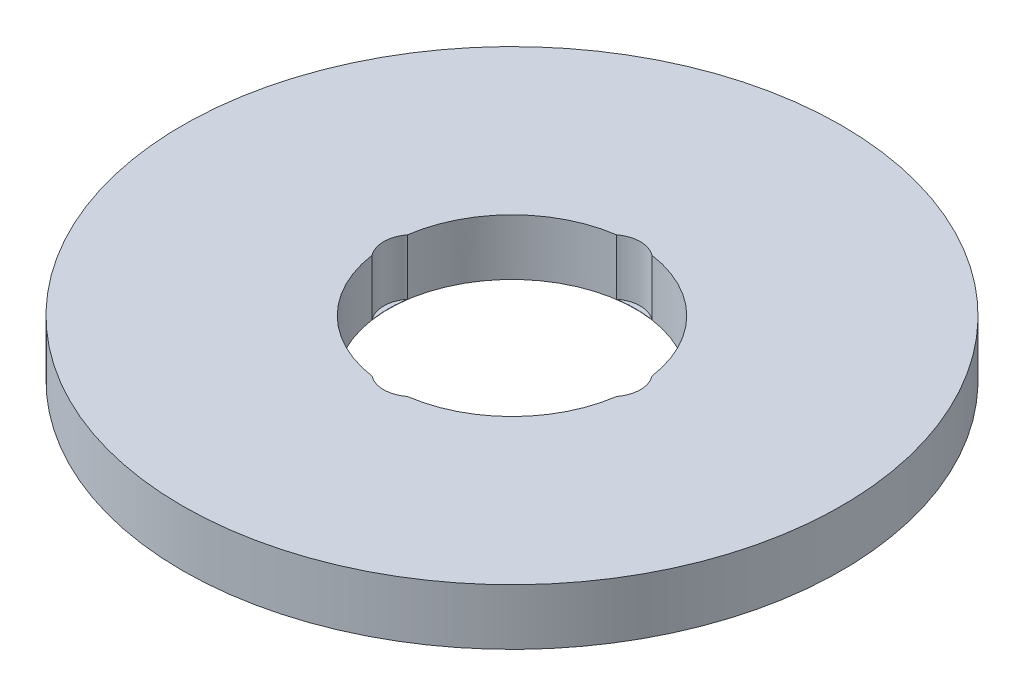
ISO-10303-21;
HEADER;
FILE_DESCRIPTION(('STEP AP214'),'2;1');
FILE_NAME('part.step','',(''),(''),'','','');
FILE_SCHEMA(('AUTOMOTIVE_DESIGN { 1 0 10303 214 1 1 1 1 }'));
ENDSEC;
DATA;
#1=APPLICATION_CONTEXT('core data for automotive mechanical design processes');
#2=APPLICATION_PROTOCOL_DEFINITION('international standard','automotive_design',2000,#1);
#3=PRODUCT_CONTEXT('',#1,'mechanical');
#4=PRODUCT('Part','Part','',(#3));
#5=PRODUCT_RELATED_PRODUCT_CATEGORY('part','',(#4));
#6=PRODUCT_DEFINITION_FORMATION('','',#4);
#7=PRODUCT_DEFINITION_CONTEXT('part definition',#1,'design');
#8=PRODUCT_DEFINITION('design','',#6,#7);
#9=PRODUCT_DEFINITION_SHAPE('','',#8);
#10=(LENGTH_UNIT() NAMED_UNIT(*) SI_UNIT(.MILLI.,.METRE.));
#11=(NAMED_UNIT(*) PLANE_ANGLE_UNIT() SI_UNIT($,.RADIAN.));
#12=(NAMED_UNIT(*) SI_UNIT($,.STERADIAN.) SOLID_ANGLE_UNIT());
#13=UNCERTAINTY_MEASURE_WITH_UNIT(LENGTH_MEASURE(1.E-05),#10,'distance_accuracy_value','');
#14=(GEOMETRIC_REPRESENTATION_CONTEXT(3) GLOBAL_UNCERTAINTY_ASSIGNED_CONTEXT((#13)) GLOBAL_UNIT_ASSIGNED_CONTEXT((#10,
#11,#12)) REPRESENTATION_CONTEXT('',''));
#15=CARTESIAN_POINT('',(0.,0.,0.));
#16=DIRECTION('',(0.,0.,1.));
#17=DIRECTION('',(1.,0.,0.));
#18=AXIS2_PLACEMENT_3D('',#15,#16,#17);
#19=CARTESIAN_POINT('',(0.,17.,0.));
#20=DIRECTION('',(0.,-1.,0.));
#21=DIRECTION('',(0.,0.,-1.));
#22=AXIS2_PLACEMENT_3D('',#19,#20,#21);
#23=CYLINDRICAL_SURFACE('',#22,100.);
#24=CARTESIAN_POINT('',(0.,17.,0.));
#25=DIRECTION('',(0.,1.,0.));
#26=DIRECTION('',(0.,0.,1.));
#27=AXIS2_PLACEMENT_3D('',#24,#25,#26);
#28=CIRCLE('',#27,100.);
#29=CARTESIAN_POINT('',(0.,17.,100.));
#30=VERTEX_POINT('',#29);
#31=EDGE_CURVE('E148',#30,#30,#28,.T.);
#32=ORIENTED_EDGE('',*,*,#31,.F.);
#33=EDGE_LOOP('',(#32));
#34=FACE_BOUND('',#33,.T.);
#35=CARTESIAN_POINT('',(0.,0.,0.));
#36=DIRECTION('',(0.,1.,0.));
#37=DIRECTION('',(0.,0.,1.));
#38=AXIS2_PLACEMENT_3D('',#35,#36,#37);
#39=CIRCLE('',#38,100.);
#40=CARTESIAN_POINT('',(0.,0.,100.));
#41=VERTEX_POINT('',#40);
#42=EDGE_CURVE('E139',#41,#41,#39,.T.);
#43=ORIENTED_EDGE('',*,*,#42,.T.);
#44=EDGE_LOOP('',(#43));
#45=FACE_BOUND('',#44,.T.);
#46=ADVANCED_FACE('F39',(#34,#45),#23,.T.);
#47=CARTESIAN_POINT('',(0.,17.,0.));
#48=DIRECTION('',(0.,1.,0.));
#49=DIRECTION('',(0.,0.,1.));
#50=AXIS2_PLACEMENT_3D('',#47,#48,#49);
#51=PLANE('',#50);
#52=CARTESIAN_POINT('',(1.05184979151437E-13,17.,30.1261753804159));
#53=DIRECTION('',(0.,1.,0.));
#54=DIRECTION('',(1.,0.,0.));
#55=AXIS2_PLACEMENT_3D('',#52,#53,#54);
#56=CIRCLE('',#55,8.80579560288896);
#57=CARTESIAN_POINT('',(-5.35647048871262,17.,37.115471489711));
#58=VERTEX_POINT('',#57);
#59=CARTESIAN_POINT('',(5.35647048871288,17.,37.115471489711));
#60=VERTEX_POINT('',#59);
#61=EDGE_CURVE('E175',#58,#60,#56,.T.);
#62=ORIENTED_EDGE('',*,*,#61,.F.);
#63=CARTESIAN_POINT('',(0.,17.,0.));
#64=DIRECTION('',(0.,1.,0.));
#65=DIRECTION('',(0.,0.,1.));
#66=AXIS2_PLACEMENT_3D('',#63,#64,#65);
#67=CIRCLE('',#66,37.5);
#68=CARTESIAN_POINT('',(-37.115471489711,17.,5.35647048871274));
#69=VERTEX_POINT('',#68);
#70=EDGE_CURVE('E134',#69,#58,#67,.T.);
#71=ORIENTED_EDGE('',*,*,#70,.F.);
#72=CARTESIAN_POINT('',(-30.1261753804159,17.,0.));
#73=DIRECTION('',(0.,1.,0.));
#74=DIRECTION('',(0.,0.,1.));
#75=AXIS2_PLACEMENT_3D('',#72,#73,#74);
#76=CIRCLE('',#75,8.80579560288896);
#77=CARTESIAN_POINT('',(-37.115471489711,17.,-5.35647048871274));
#78=VERTEX_POINT('',#77);
#79=EDGE_CURVE('E143',#78,#69,#76,.T.);
#80=ORIENTED_EDGE('',*,*,#79,.F.);
#81=CARTESIAN_POINT('',(-5.35647048871313,17.,-37.1154714897109));
#82=VERTEX_POINT('',#81);
#83=EDGE_CURVE('E123',#82,#78,#67,.T.);
#84=ORIENTED_EDGE('',*,*,#83,.F.);
#85=CARTESIAN_POINT('',(-3.15554937454312E-13,17.,-30.1261753804159));
#86=DIRECTION('',(0.,1.,0.));
#87=DIRECTION('',(-1.,0.,0.));
#88=AXIS2_PLACEMENT_3D('',#85,#86,#87);
#89=CIRCLE('',#88,8.80579560288896);
#90=CARTESIAN_POINT('',(5.35647048871236,17.,-37.1154714897111));
#91=VERTEX_POINT('',#90);
#92=EDGE_CURVE('E106',#91,#82,#89,.T.);
#93=ORIENTED_EDGE('',*,*,#92,.F.);
#94=CARTESIAN_POINT('',(37.115471489711,17.,-5.35647048871274));
#95=VERTEX_POINT('',#94);
#96=EDGE_CURVE('E125',#95,#91,#67,.T.);
#97=ORIENTED_EDGE('',*,*,#96,.F.);
#98=CARTESIAN_POINT('',(30.1261753804159,17.,0.));
#99=DIRECTION('',(0.,1.,0.));
#100=DIRECTION('',(0.,0.,-1.));
#101=AXIS2_PLACEMENT_3D('',#98,#99,#100);
#102=CIRCLE('',#101,8.80579560288896);
#103=CARTESIAN_POINT('',(37.115471489711,17.,5.35647048871274));
#104=VERTEX_POINT('',#103);
#105=EDGE_CURVE('E286',#104,#95,#102,.T.);
#106=ORIENTED_EDGE('',*,*,#105,.F.);
#107=EDGE_CURVE('E135',#60,#104,#67,.T.);
#108=ORIENTED_EDGE('',*,*,#107,.F.);
#109=EDGE_LOOP('',(#62,#71,#80,#84,#93,#97,#106,#108));
#110=FACE_BOUND('',#109,.T.);
#111=ORIENTED_EDGE('',*,*,#31,.T.);
#112=EDGE_LOOP('',(#111));
#113=FACE_BOUND('',#112,.T.);
#114=ADVANCED_FACE('F118',(#110,#113),#51,.T.);
#115=CARTESIAN_POINT('',(0.,0.,0.));
#116=DIRECTION('',(0.,1.,0.));
#117=DIRECTION('',(0.,0.,1.));
#118=AXIS2_PLACEMENT_3D('',#115,#116,#117);
#119=PLANE('',#118);
#120=CARTESIAN_POINT('',(0.,0.,0.));
#121=DIRECTION('',(0.,1.,0.));
#122=DIRECTION('',(0.,0.,1.));
#123=AXIS2_PLACEMENT_3D('',#120,#121,#122);
#124=CIRCLE('',#123,37.5);
#125=CARTESIAN_POINT('',(0.,0.,37.5));
#126=VERTEX_POINT('',#125);
#127=EDGE_CURVE('E136',#126,#126,#124,.T.);
#128=ORIENTED_EDGE('',*,*,#127,.T.);
#129=EDGE_LOOP('',(#128));
#130=FACE_BOUND('',#129,.T.);
#131=ORIENTED_EDGE('',*,*,#42,.F.);
#132=EDGE_LOOP('',(#131));
#133=FACE_BOUND('',#132,.T.);
#134=ADVANCED_FACE('F187',(#130,#133),#119,.F.);
#135=CARTESIAN_POINT('',(0.,17.,0.));
#136=DIRECTION('',(0.,-1.,0.));
#137=DIRECTION('',(0.,0.,-1.));
#138=AXIS2_PLACEMENT_3D('',#135,#136,#137);
#139=CYLINDRICAL_SURFACE('',#138,37.5);
#140=DIRECTION('',(0.,1.,0.));
#141=VECTOR('',#140,1.);
#142=CARTESIAN_POINT('',(-5.35647048871261,8.54095868905206,37.115471489711));
#143=LINE('',#142,#141);
#144=CARTESIAN_POINT('',(-5.35647048871262,0.0819173781041252,37.115471489711));
#145=VERTEX_POINT('',#144);
#146=EDGE_CURVE('E11',#145,#58,#143,.T.);
#147=ORIENTED_EDGE('',*,*,#146,.F.);
#148=CARTESIAN_POINT('',(0.,0.0819173781041252,0.));
#149=DIRECTION('',(0.,1.,0.));
#150=DIRECTION('',(0.,0.,1.));
#151=AXIS2_PLACEMENT_3D('',#148,#149,#150);
#152=CIRCLE('',#151,37.5);
#153=CARTESIAN_POINT('',(5.35647048871288,0.0819173781041252,37.115471489711));
#154=VERTEX_POINT('',#153);
#155=EDGE_CURVE('E170',#145,#154,#152,.T.);
#156=ORIENTED_EDGE('',*,*,#155,.T.);
#157=DIRECTION('',(0.,1.,0.));
#158=VECTOR('',#157,1.);
#159=CARTESIAN_POINT('',(5.35647048871287,8.54095868905206,37.115471489711));
#160=LINE('',#159,#158);
#161=EDGE_CURVE('E46',#60,#154,#160,.F.);
#162=ORIENTED_EDGE('',*,*,#161,.F.);
#163=ORIENTED_EDGE('',*,*,#107,.T.);
#164=DIRECTION('',(0.,1.,0.));
#165=VECTOR('',#164,1.);
#166=CARTESIAN_POINT('',(37.115471489711,8.54095868905206,5.35647048871274));
#167=LINE('',#166,#165);
#168=CARTESIAN_POINT('',(37.115471489711,0.0819173781041252,5.35647048871274));
#169=VERTEX_POINT('',#168);
#170=EDGE_CURVE('E164',#169,#104,#167,.T.);
#171=ORIENTED_EDGE('',*,*,#170,.F.);
#172=CARTESIAN_POINT('',(0.,0.0819173781041252,0.));
#173=DIRECTION('',(0.,1.,0.));
#174=DIRECTION('',(0.,0.,1.));
#175=AXIS2_PLACEMENT_3D('',#172,#173,#174);
#176=CIRCLE('',#175,37.5);
#177=CARTESIAN_POINT('',(37.115471489711,0.0819173781041252,-5.35647048871274));
#178=VERTEX_POINT('',#177);
#179=EDGE_CURVE('E115',#169,#178,#176,.T.);
#180=ORIENTED_EDGE('',*,*,#179,.T.);
#181=DIRECTION('',(0.,1.,0.));
#182=VECTOR('',#181,1.);
#183=CARTESIAN_POINT('',(37.115471489711,8.54095868905206,-5.35647048871274));
#184=LINE('',#183,#182);
#185=EDGE_CURVE('E131',#95,#178,#184,.F.);
#186=ORIENTED_EDGE('',*,*,#185,.F.);
#187=ORIENTED_EDGE('',*,*,#96,.T.);
#188=DIRECTION('',(0.,1.,0.));
#189=VECTOR('',#188,1.);
#190=CARTESIAN_POINT('',(5.35647048871235,8.54095868905206,-37.1154714897111));
#191=LINE('',#190,#189);
#192=CARTESIAN_POINT('',(5.35647048871236,0.0819173781041252,-37.1154714897111));
#193=VERTEX_POINT('',#192);
#194=EDGE_CURVE('E105',#193,#91,#191,.T.);
#195=ORIENTED_EDGE('',*,*,#194,.F.);
#196=CARTESIAN_POINT('',(0.,0.0819173781041252,0.));
#197=DIRECTION('',(0.,1.,0.));
#198=DIRECTION('',(0.,0.,1.));
#199=AXIS2_PLACEMENT_3D('',#196,#197,#198);
#200=CIRCLE('',#199,37.5);
#201=CARTESIAN_POINT('',(-5.35647048871313,0.0819173781041252,-37.1154714897109));
#202=VERTEX_POINT('',#201);
#203=EDGE_CURVE('E159',#193,#202,#200,.T.);
#204=ORIENTED_EDGE('',*,*,#203,.T.);
#205=DIRECTION('',(0.,1.,0.));
#206=VECTOR('',#205,1.);
#207=CARTESIAN_POINT('',(-5.35647048871313,8.54095868905206,-37.1154714897109));
#208=LINE('',#207,#206);
#209=EDGE_CURVE('E114',#82,#202,#208,.F.);
#210=ORIENTED_EDGE('',*,*,#209,.F.);
#211=ORIENTED_EDGE('',*,*,#83,.T.);
#212=DIRECTION('',(0.,1.,0.));
#213=VECTOR('',#212,1.);
#214=CARTESIAN_POINT('',(-37.115471489711,8.54095868905206,-5.35647048871274));
#215=LINE('',#214,#213);
#216=CARTESIAN_POINT('',(-37.115471489711,0.0819173781041252,-5.35647048871274));
#217=VERTEX_POINT('',#216);
#218=EDGE_CURVE('E160',#217,#78,#215,.T.);
#219=ORIENTED_EDGE('',*,*,#218,.F.);
#220=CARTESIAN_POINT('',(0.,0.0819173781041252,0.));
#221=DIRECTION('',(0.,1.,0.));
#222=DIRECTION('',(0.,0.,1.));
#223=AXIS2_PLACEMENT_3D('',#220,#221,#222);
#224=CIRCLE('',#223,37.5);
#225=CARTESIAN_POINT('',(-37.115471489711,0.0819173781041252,5.35647048871274));
#226=VERTEX_POINT('',#225);
#227=EDGE_CURVE('E149',#217,#226,#224,.T.);
#228=ORIENTED_EDGE('',*,*,#227,.T.);
#229=DIRECTION('',(0.,1.,0.));
#230=VECTOR('',#229,1.);
#231=CARTESIAN_POINT('',(-37.115471489711,8.54095868905206,5.35647048871274));
#232=LINE('',#231,#230);
#233=EDGE_CURVE('E152',#69,#226,#232,.F.);
#234=ORIENTED_EDGE('',*,*,#233,.F.);
#235=ORIENTED_EDGE('',*,*,#70,.T.);
#236=EDGE_LOOP('',(#147,#156,#162,#163,#171,#180,#186,#187,#195,#204,#210,#211,#219,#228,#234,#235));
#237=FACE_BOUND('',#236,.T.);
#238=ORIENTED_EDGE('',*,*,#127,.F.);
#239=EDGE_LOOP('',(#238));
#240=FACE_BOUND('',#239,.T.);
#241=ADVANCED_FACE('F126',(#237,#240),#139,.F.);
#242=CARTESIAN_POINT('',(-30.1261753804159,0.0819173781041252,0.));
#243=DIRECTION('',(0.,1.,0.));
#244=DIRECTION('',(0.,0.,1.));
#245=AXIS2_PLACEMENT_3D('',#242,#243,#244);
#246=CYLINDRICAL_SURFACE('',#245,8.80579560288896);
#247=ORIENTED_EDGE('',*,*,#218,.T.);
#248=ORIENTED_EDGE('',*,*,#79,.T.);
#249=ORIENTED_EDGE('',*,*,#233,.T.);
#250=CARTESIAN_POINT('',(-30.1261753804159,0.0819173781041252,0.));
#251=DIRECTION('',(0.,1.,0.));
#252=DIRECTION('',(0.,0.,1.));
#253=AXIS2_PLACEMENT_3D('',#250,#251,#252);
#254=CIRCLE('',#253,8.80579560288896);
#255=EDGE_CURVE('E144',#217,#226,#254,.T.);
#256=ORIENTED_EDGE('',*,*,#255,.F.);
#257=EDGE_LOOP('',(#247,#248,#249,#256));
#258=FACE_BOUND('',#257,.T.);
#259=ADVANCED_FACE('F200',(#258),#246,.F.);
#260=CARTESIAN_POINT('',(-30.1261753804159,0.0819173781041252,0.));
#261=DIRECTION('',(0.,1.,0.));
#262=DIRECTION('',(0.,0.,1.));
#263=AXIS2_PLACEMENT_3D('',#260,#261,#262);
#264=PLANE('',#263);
#265=ORIENTED_EDGE('',*,*,#255,.T.);
#266=ORIENTED_EDGE('',*,*,#227,.F.);
#267=EDGE_LOOP('',(#265,#266));
#268=FACE_BOUND('',#267,.T.);
#269=ADVANCED_FACE('F201',(#268),#264,.T.);
#270=CARTESIAN_POINT('',(-3.15554937454312E-13,0.0819173781041252,-30.1261753804159));
#271=DIRECTION('',(0.,1.,0.));
#272=DIRECTION('',(0.,0.,1.));
#273=AXIS2_PLACEMENT_3D('',#270,#271,#272);
#274=CYLINDRICAL_SURFACE('',#273,8.80579560288896);
#275=ORIENTED_EDGE('',*,*,#194,.T.);
#276=ORIENTED_EDGE('',*,*,#92,.T.);
#277=ORIENTED_EDGE('',*,*,#209,.T.);
#278=CARTESIAN_POINT('',(-3.15554937454312E-13,0.0819173781041252,-30.1261753804159));
#279=DIRECTION('',(0.,1.,0.));
#280=DIRECTION('',(-1.,0.,0.));
#281=AXIS2_PLACEMENT_3D('',#278,#279,#280);
#282=CIRCLE('',#281,8.80579560288896);
#283=EDGE_CURVE('E107',#193,#202,#282,.T.);
#284=ORIENTED_EDGE('',*,*,#283,.F.);
#285=EDGE_LOOP('',(#275,#276,#277,#284));
#286=FACE_BOUND('',#285,.T.);
#287=ADVANCED_FACE('F102',(#286),#274,.F.);
#288=CARTESIAN_POINT('',(-3.15554937454312E-13,0.0819173781041252,-30.1261753804159));
#289=DIRECTION('',(0.,1.,0.));
#290=DIRECTION('',(-1.,0.,0.));
#291=AXIS2_PLACEMENT_3D('',#288,#289,#290);
#292=PLANE('',#291);
#293=ORIENTED_EDGE('',*,*,#283,.T.);
#294=ORIENTED_EDGE('',*,*,#203,.F.);
#295=EDGE_LOOP('',(#293,#294));
#296=FACE_BOUND('',#295,.T.);
#297=ADVANCED_FACE('F209',(#296),#292,.T.);
#298=CARTESIAN_POINT('',(30.1261753804159,0.0819173781041252,0.));
#299=DIRECTION('',(0.,1.,0.));
#300=DIRECTION('',(0.,0.,1.));
#301=AXIS2_PLACEMENT_3D('',#298,#299,#300);
#302=CYLINDRICAL_SURFACE('',#301,8.80579560288896);
#303=ORIENTED_EDGE('',*,*,#170,.T.);
#304=ORIENTED_EDGE('',*,*,#105,.T.);
#305=ORIENTED_EDGE('',*,*,#185,.T.);
#306=CARTESIAN_POINT('',(30.1261753804159,0.0819173781041252,0.));
#307=DIRECTION('',(0.,1.,0.));
#308=DIRECTION('',(0.,0.,-1.));
#309=AXIS2_PLACEMENT_3D('',#306,#307,#308);
#310=CIRCLE('',#309,8.80579560288896);
#311=EDGE_CURVE('E56',#169,#178,#310,.T.);
#312=ORIENTED_EDGE('',*,*,#311,.F.);
#313=EDGE_LOOP('',(#303,#304,#305,#312));
#314=FACE_BOUND('',#313,.T.);
#315=ADVANCED_FACE('F213',(#314),#302,.F.);
#316=CARTESIAN_POINT('',(30.1261753804159,0.0819173781041252,0.));
#317=DIRECTION('',(0.,1.,0.));
#318=DIRECTION('',(0.,0.,-1.));
#319=AXIS2_PLACEMENT_3D('',#316,#317,#318);
#320=PLANE('',#319);
#321=ORIENTED_EDGE('',*,*,#311,.T.);
#322=ORIENTED_EDGE('',*,*,#179,.F.);
#323=EDGE_LOOP('',(#321,#322));
#324=FACE_BOUND('',#323,.T.);
#325=ADVANCED_FACE('F179',(#324),#320,.T.);
#326=CARTESIAN_POINT('',(1.05184979151437E-13,0.0819173781041252,30.1261753804159));
#327=DIRECTION('',(0.,1.,0.));
#328=DIRECTION('',(0.,0.,1.));
#329=AXIS2_PLACEMENT_3D('',#326,#327,#328);
#330=CYLINDRICAL_SURFACE('',#329,8.80579560288896);
#331=ORIENTED_EDGE('',*,*,#146,.T.);
#332=ORIENTED_EDGE('',*,*,#61,.T.);
#333=ORIENTED_EDGE('',*,*,#161,.T.);
#334=CARTESIAN_POINT('',(1.05184979151437E-13,0.0819173781041252,30.1261753804159));
#335=DIRECTION('',(0.,1.,0.));
#336=DIRECTION('',(1.,0.,0.));
#337=AXIS2_PLACEMENT_3D('',#334,#335,#336);
#338=CIRCLE('',#337,8.80579560288896);
#339=EDGE_CURVE('E55',#145,#154,#338,.T.);
#340=ORIENTED_EDGE('',*,*,#339,.F.);
#341=EDGE_LOOP('',(#331,#332,#333,#340));
#342=FACE_BOUND('',#341,.T.);
#343=ADVANCED_FACE('F171',(#342),#330,.F.);
#344=CARTESIAN_POINT('',(1.05184979151437E-13,0.0819173781041252,30.1261753804159));
#345=DIRECTION('',(0.,1.,0.));
#346=DIRECTION('',(1.,0.,0.));
#347=AXIS2_PLACEMENT_3D('',#344,#345,#346);
#348=PLANE('',#347);
#349=ORIENTED_EDGE('',*,*,#339,.T.);
#350=ORIENTED_EDGE('',*,*,#155,.F.);
#351=EDGE_LOOP('',(#349,#350));
#352=FACE_BOUND('',#351,.T.);
#353=ADVANCED_FACE('F173',(#352),#348,.T.);
#354=CLOSED_SHELL('',(#46,#114,#134,#241,#259,#269,#287,#297,#315,#325,#343,#353));
#355=MANIFOLD_SOLID_BREP('B2',#354);
#356=ADVANCED_BREP_SHAPE_REPRESENTATION('',(#18,#355),#14);
#357=SHAPE_DEFINITION_REPRESENTATION(#9,#356);
ENDSEC;
END-ISO-10303-21;
